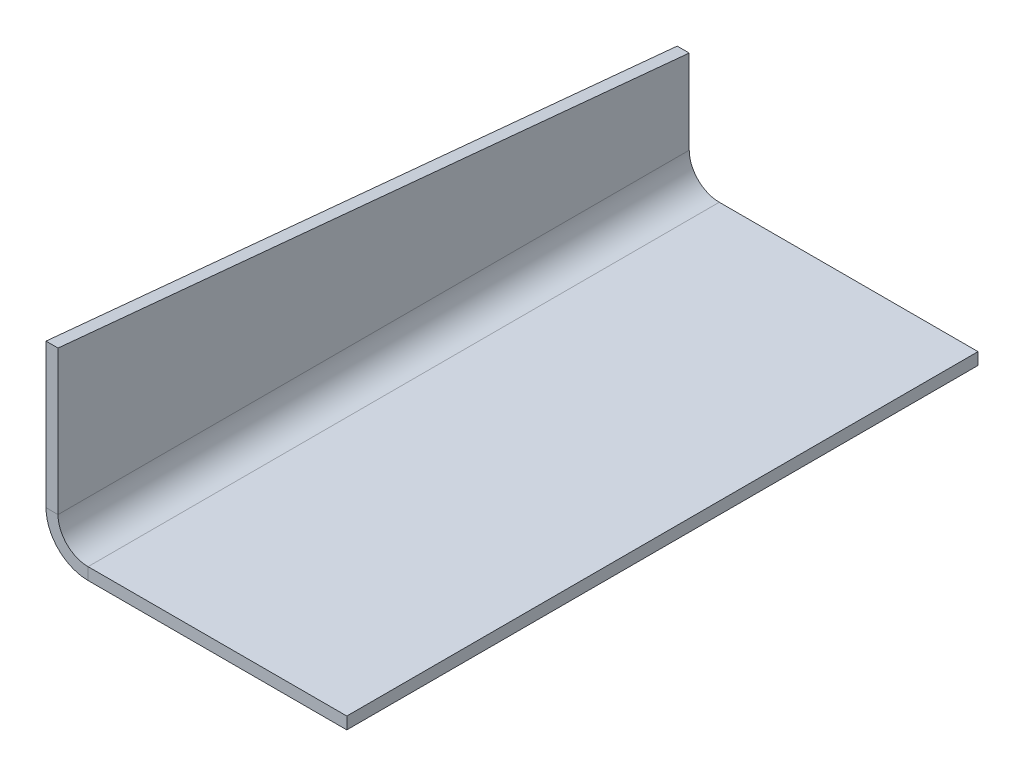
ISO-10303-21;
HEADER;
FILE_DESCRIPTION(('STEP AP214'),'2;1');
FILE_NAME('part.step','',(''),(''),'','','');
FILE_SCHEMA(('AUTOMOTIVE_DESIGN { 1 0 10303 214 1 1 1 1 }'));
ENDSEC;
DATA;
#1=APPLICATION_CONTEXT('core data for automotive mechanical design processes');
#2=APPLICATION_PROTOCOL_DEFINITION('international standard','automotive_design',2000,#1);
#3=PRODUCT_CONTEXT('',#1,'mechanical');
#4=PRODUCT('Part','Part','',(#3));
#5=PRODUCT_RELATED_PRODUCT_CATEGORY('part','',(#4));
#6=PRODUCT_DEFINITION_FORMATION('','',#4);
#7=PRODUCT_DEFINITION_CONTEXT('part definition',#1,'design');
#8=PRODUCT_DEFINITION('design','',#6,#7);
#9=PRODUCT_DEFINITION_SHAPE('','',#8);
#10=(LENGTH_UNIT() NAMED_UNIT(*) SI_UNIT(.MILLI.,.METRE.));
#11=(NAMED_UNIT(*) PLANE_ANGLE_UNIT() SI_UNIT($,.RADIAN.));
#12=(NAMED_UNIT(*) SI_UNIT($,.STERADIAN.) SOLID_ANGLE_UNIT());
#13=UNCERTAINTY_MEASURE_WITH_UNIT(LENGTH_MEASURE(1.E-05),#10,'distance_accuracy_value','');
#14=(GEOMETRIC_REPRESENTATION_CONTEXT(3) GLOBAL_UNCERTAINTY_ASSIGNED_CONTEXT((#13)) GLOBAL_UNIT_ASSIGNED_CONTEXT((#10,
#11,#12)) REPRESENTATION_CONTEXT('',''));
#15=CARTESIAN_POINT('',(0.,0.,0.));
#16=DIRECTION('',(0.,0.,1.));
#17=DIRECTION('',(1.,0.,0.));
#18=AXIS2_PLACEMENT_3D('',#15,#16,#17);
#19=CARTESIAN_POINT('',(330.750713813699,57.9885896402802,210.));
#20=DIRECTION('',(0.,0.995495472593952,-0.0948090926279955));
#21=DIRECTION('',(0.,0.0948090926279955,0.995495472593952));
#22=AXIS2_PLACEMENT_3D('',#19,#20,#21);
#23=PLANE('',#22);
#24=CARTESIAN_POINT('',(-100.075955442805,57.9885896373081,210.000000000283));
#25=CARTESIAN_POINT('',(-100.075955442805,57.155256303982,201.250000000238));
#26=CARTESIAN_POINT('',(-100.075955442805,56.3219229706471,192.500000000194));
#27=CARTESIAN_POINT('',(-100.075955442805,54.6552563039773,175.000000000195));
#28=CARTESIAN_POINT('',(-100.075955442805,53.8219229706424,166.250000000239));
#29=CARTESIAN_POINT('',(-100.075955442805,52.1552563039737,148.750000000327));
#30=CARTESIAN_POINT('',(-100.075955442805,51.3219229706399,140.000000000371));
#31=CARTESIAN_POINT('',(-100.075955442805,49.6552563039722,122.500000000415));
#32=CARTESIAN_POINT('',(-100.075955442805,48.8219229706383,113.750000000416));
#33=CARTESIAN_POINT('',(-100.075955442805,47.1552563039737,96.2500000003713));
#34=CARTESIAN_POINT('',(-100.075955442805,46.3219229706431,87.500000000327));
#35=CARTESIAN_POINT('',(-100.075955442805,44.6552563039773,70.0000000002828));
#36=CARTESIAN_POINT('',(-100.075955442805,43.8219229706421,61.250000000283));
#37=CARTESIAN_POINT('',(-100.075955442805,42.155256303974,43.7500000002831));
#38=CARTESIAN_POINT('',(-100.075955442805,41.3219229706411,35.0000000002831));
#39=CARTESIAN_POINT('',(-100.075955442805,39.6552563039751,17.500000000283));
#40=CARTESIAN_POINT('',(-100.075955442805,38.8219229706421,8.75000000028298));
#41=CARTESIAN_POINT('',(-100.075955442805,37.9885896373081,2.83061998593547E-10));
#42=B_SPLINE_CURVE_WITH_KNOTS('',3,(#24,#25,#26,#27,#28,#29,#30,#31,#32,#33,#34,#35,#36,#37,#38,
#39,#40,#41),.UNSPECIFIED.,.F.,.F.,(4,2,2,2,2,2,2,2,4),(0.,26.3687788872928,52.7375577743225,
79.1063366613521,105.475115548513,131.843894435806,158.212673322967,184.581452210129,
210.95023109729),.UNSPECIFIED.);
#43=CARTESIAN_POINT('',(-100.075955442805,57.9885896402802,210.));
#44=VERTEX_POINT('',#43);
#45=CARTESIAN_POINT('',(-100.075955442805,37.9885896402802,0.));
#46=VERTEX_POINT('',#45);
#47=EDGE_CURVE('E133',#44,#46,#42,.T.);
#48=ORIENTED_EDGE('',*,*,#47,.F.);
#49=DIRECTION('',(-1.,0.,0.));
#50=VECTOR('',#49,1.);
#51=CARTESIAN_POINT('',(330.750713813699,57.9885896402802,210.));
#52=LINE('',#51,#50);
#53=CARTESIAN_POINT('',(-96.0759554428049,57.9885896402802,210.));
#54=VERTEX_POINT('',#53);
#55=EDGE_CURVE('E184',#54,#44,#52,.T.);
#56=ORIENTED_EDGE('',*,*,#55,.F.);
#57=DIRECTION('',(0.,-0.0948090926279955,-0.995495472593952));
#58=VECTOR('',#57,1.);
#59=CARTESIAN_POINT('',(-96.0759554428049,57.9885896402802,210.));
#60=LINE('',#59,#58);
#61=CARTESIAN_POINT('',(-96.0759554428049,37.9885896402802,0.));
#62=VERTEX_POINT('',#61);
#63=EDGE_CURVE('E143',#54,#62,#60,.T.);
#64=ORIENTED_EDGE('',*,*,#63,.T.);
#65=DIRECTION('',(-1.,0.,0.));
#66=VECTOR('',#65,1.);
#67=CARTESIAN_POINT('',(330.750713813699,37.9885896402802,0.));
#68=LINE('',#67,#66);
#69=EDGE_CURVE('E126',#62,#46,#68,.T.);
#70=ORIENTED_EDGE('',*,*,#69,.T.);
#71=EDGE_LOOP('',(#48,#56,#64,#70));
#72=FACE_BOUND('',#71,.T.);
#73=ADVANCED_FACE('F37',(#72),#23,.T.);
#74=CARTESIAN_POINT('',(330.750713813699,10.0000000000001,0.));
#75=DIRECTION('',(0.,0.,1.));
#76=DIRECTION('',(-1.,0.,0.));
#77=AXIS2_PLACEMENT_3D('',#74,#75,#76);
#78=PLANE('',#77);
#79=DIRECTION('',(-1.,0.,0.));
#80=VECTOR('',#79,1.);
#81=CARTESIAN_POINT('',(330.750713813699,9.99999999999999,0.));
#82=LINE('',#81,#80);
#83=CARTESIAN_POINT('',(-96.0759554428049,9.99999999999999,0.));
#84=VERTEX_POINT('',#83);
#85=CARTESIAN_POINT('',(-100.075955442805,10.,0.));
#86=VERTEX_POINT('',#85);
#87=EDGE_CURVE('E117',#84,#86,#82,.T.);
#88=ORIENTED_EDGE('',*,*,#87,.T.);
#89=DIRECTION('',(0.,1.,0.));
#90=VECTOR('',#89,1.);
#91=CARTESIAN_POINT('',(-100.075955442805,0.,0.));
#92=LINE('',#91,#90);
#93=EDGE_CURVE('E120',#86,#46,#92,.T.);
#94=ORIENTED_EDGE('',*,*,#93,.T.);
#95=ORIENTED_EDGE('',*,*,#69,.F.);
#96=DIRECTION('',(0.,1.,0.));
#97=VECTOR('',#96,1.);
#98=CARTESIAN_POINT('',(-96.0759554428049,10.0000000000001,0.));
#99=LINE('',#98,#97);
#100=EDGE_CURVE('E11',#84,#62,#99,.T.);
#101=ORIENTED_EDGE('',*,*,#100,.F.);
#102=EDGE_LOOP('',(#88,#94,#95,#101));
#103=FACE_BOUND('',#102,.T.);
#104=ADVANCED_FACE('F119',(#103),#78,.F.);
#105=CARTESIAN_POINT('',(-100.075955442805,0.,0.));
#106=DIRECTION('',(1.,0.,0.));
#107=DIRECTION('',(0.,0.,-1.));
#108=AXIS2_PLACEMENT_3D('',#105,#106,#107);
#109=PLANE('',#108);
#110=ORIENTED_EDGE('',*,*,#47,.T.);
#111=ORIENTED_EDGE('',*,*,#93,.F.);
#112=DIRECTION('',(0.,0.,-1.));
#113=VECTOR('',#112,1.);
#114=CARTESIAN_POINT('',(-100.075955442805,10.,210.));
#115=LINE('',#114,#113);
#116=CARTESIAN_POINT('',(-100.075955442805,9.99999999999999,210.));
#117=VERTEX_POINT('',#116);
#118=EDGE_CURVE('E131',#117,#86,#115,.T.);
#119=ORIENTED_EDGE('',*,*,#118,.F.);
#120=DIRECTION('',(0.,1.,0.));
#121=VECTOR('',#120,1.);
#122=CARTESIAN_POINT('',(-100.075955442805,0.,210.));
#123=LINE('',#122,#121);
#124=EDGE_CURVE('E189',#117,#44,#123,.T.);
#125=ORIENTED_EDGE('',*,*,#124,.T.);
#126=EDGE_LOOP('',(#110,#111,#119,#125));
#127=FACE_BOUND('',#126,.T.);
#128=ADVANCED_FACE('F130',(#127),#109,.F.);
#129=CARTESIAN_POINT('',(330.750713813699,10.0000000000001,210.));
#130=DIRECTION('',(0.,0.,1.));
#131=DIRECTION('',(-1.,0.,0.));
#132=AXIS2_PLACEMENT_3D('',#129,#130,#131);
#133=PLANE('',#132);
#134=ORIENTED_EDGE('',*,*,#124,.F.);
#135=DIRECTION('',(-1.,0.,0.));
#136=VECTOR('',#135,1.);
#137=CARTESIAN_POINT('',(330.750713813699,9.99999999999999,210.));
#138=LINE('',#137,#136);
#139=CARTESIAN_POINT('',(-96.0759554428049,9.99999999999999,210.));
#140=VERTEX_POINT('',#139);
#141=EDGE_CURVE('E43',#140,#117,#138,.T.);
#142=ORIENTED_EDGE('',*,*,#141,.F.);
#143=DIRECTION('',(0.,1.,0.));
#144=VECTOR('',#143,1.);
#145=CARTESIAN_POINT('',(-96.0759554428049,10.0000000000001,210.));
#146=LINE('',#145,#144);
#147=EDGE_CURVE('E58',#140,#54,#146,.T.);
#148=ORIENTED_EDGE('',*,*,#147,.T.);
#149=ORIENTED_EDGE('',*,*,#55,.T.);
#150=EDGE_LOOP('',(#134,#142,#148,#149));
#151=FACE_BOUND('',#150,.T.);
#152=ADVANCED_FACE('F210',(#151),#133,.T.);
#153=CARTESIAN_POINT('',(-96.0759554428049,0.,0.));
#154=DIRECTION('',(1.,0.,0.));
#155=DIRECTION('',(0.,0.,-1.));
#156=AXIS2_PLACEMENT_3D('',#153,#154,#155);
#157=PLANE('',#156);
#158=ORIENTED_EDGE('',*,*,#63,.F.);
#159=ORIENTED_EDGE('',*,*,#147,.F.);
#160=DIRECTION('',(0.,0.,-1.));
#161=VECTOR('',#160,1.);
#162=CARTESIAN_POINT('',(-96.0759554428049,9.99999999999999,210.));
#163=LINE('',#162,#161);
#164=EDGE_CURVE('E49',#140,#84,#163,.T.);
#165=ORIENTED_EDGE('',*,*,#164,.T.);
#166=ORIENTED_EDGE('',*,*,#100,.T.);
#167=EDGE_LOOP('',(#158,#159,#165,#166));
#168=FACE_BOUND('',#167,.T.);
#169=ADVANCED_FACE('F206',(#168),#157,.T.);
#170=CARTESIAN_POINT('',(0.,-4.,0.));
#171=DIRECTION('',(0.,1.,0.));
#172=DIRECTION('',(0.,0.,1.));
#173=AXIS2_PLACEMENT_3D('',#170,#171,#172);
#174=PLANE('',#173);
#175=DIRECTION('',(0.,0.,1.));
#176=VECTOR('',#175,1.);
#177=CARTESIAN_POINT('',(-86.0759554428049,-4.,0.));
#178=LINE('',#177,#176);
#179=CARTESIAN_POINT('',(-86.0759554428049,-4.,210.));
#180=VERTEX_POINT('',#179);
#181=CARTESIAN_POINT('',(-86.0759554428049,-4.,0.));
#182=VERTEX_POINT('',#181);
#183=EDGE_CURVE('E150',#180,#182,#178,.F.);
#184=ORIENTED_EDGE('',*,*,#183,.T.);
#185=DIRECTION('',(1.,0.,0.));
#186=VECTOR('',#185,1.);
#187=CARTESIAN_POINT('',(0.,-4.,0.));
#188=LINE('',#187,#186);
#189=CARTESIAN_POINT('',(0.,-4.,0.));
#190=VERTEX_POINT('',#189);
#191=EDGE_CURVE('E159',#190,#182,#188,.F.);
#192=ORIENTED_EDGE('',*,*,#191,.F.);
#193=DIRECTION('',(0.,0.,1.));
#194=VECTOR('',#193,1.);
#195=CARTESIAN_POINT('',(0.,-4.,0.));
#196=LINE('',#195,#194);
#197=CARTESIAN_POINT('',(0.,-4.,210.));
#198=VERTEX_POINT('',#197);
#199=EDGE_CURVE('E161',#198,#190,#196,.F.);
#200=ORIENTED_EDGE('',*,*,#199,.F.);
#201=DIRECTION('',(1.,0.,0.));
#202=VECTOR('',#201,1.);
#203=CARTESIAN_POINT('',(0.,-4.,210.));
#204=LINE('',#203,#202);
#205=EDGE_CURVE('E164',#198,#180,#204,.F.);
#206=ORIENTED_EDGE('',*,*,#205,.T.);
#207=EDGE_LOOP('',(#184,#192,#200,#206));
#208=FACE_BOUND('',#207,.T.);
#209=ADVANCED_FACE('F209',(#208),#174,.F.);
#210=CARTESIAN_POINT('',(0.,449.912194616499,210.));
#211=DIRECTION('',(0.,0.,1.));
#212=DIRECTION('',(1.,0.,0.));
#213=AXIS2_PLACEMENT_3D('',#210,#211,#212);
#214=PLANE('',#213);
#215=ORIENTED_EDGE('',*,*,#205,.F.);
#216=DIRECTION('',(0.,-1.,0.));
#217=VECTOR('',#216,1.);
#218=CARTESIAN_POINT('',(0.,449.912194616499,210.));
#219=LINE('',#218,#217);
#220=CARTESIAN_POINT('',(0.,1.11022302462516E-13,210.));
#221=VERTEX_POINT('',#220);
#222=EDGE_CURVE('E177',#221,#198,#219,.T.);
#223=ORIENTED_EDGE('',*,*,#222,.F.);
#224=DIRECTION('',(-1.,0.,0.));
#225=VECTOR('',#224,1.);
#226=CARTESIAN_POINT('',(0.,0.,210.));
#227=LINE('',#226,#225);
#228=CARTESIAN_POINT('',(-86.0759554428049,1.11022302462516E-13,210.));
#229=VERTEX_POINT('',#228);
#230=EDGE_CURVE('E87',#221,#229,#227,.T.);
#231=ORIENTED_EDGE('',*,*,#230,.T.);
#232=DIRECTION('',(0.,-1.,0.));
#233=VECTOR('',#232,1.);
#234=CARTESIAN_POINT('',(-86.0759554428049,449.912194616499,210.));
#235=LINE('',#234,#233);
#236=EDGE_CURVE('E179',#229,#180,#235,.T.);
#237=ORIENTED_EDGE('',*,*,#236,.T.);
#238=EDGE_LOOP('',(#215,#223,#231,#237));
#239=FACE_BOUND('',#238,.T.);
#240=ADVANCED_FACE('F221',(#239),#214,.T.);
#241=CARTESIAN_POINT('',(0.,449.912194616499,210.));
#242=DIRECTION('',(-1.,0.,0.));
#243=DIRECTION('',(0.,0.,1.));
#244=AXIS2_PLACEMENT_3D('',#241,#242,#243);
#245=PLANE('',#244);
#246=ORIENTED_EDGE('',*,*,#222,.T.);
#247=ORIENTED_EDGE('',*,*,#199,.T.);
#248=DIRECTION('',(0.,-1.,0.));
#249=VECTOR('',#248,1.);
#250=CARTESIAN_POINT('',(0.,449.912194616499,0.));
#251=LINE('',#250,#249);
#252=CARTESIAN_POINT('',(0.,1.11022302462516E-13,0.));
#253=VERTEX_POINT('',#252);
#254=EDGE_CURVE('E174',#253,#190,#251,.T.);
#255=ORIENTED_EDGE('',*,*,#254,.F.);
#256=DIRECTION('',(0.,0.,-1.));
#257=VECTOR('',#256,1.);
#258=CARTESIAN_POINT('',(0.,0.,210.));
#259=LINE('',#258,#257);
#260=EDGE_CURVE('E95',#221,#253,#259,.T.);
#261=ORIENTED_EDGE('',*,*,#260,.F.);
#262=EDGE_LOOP('',(#246,#247,#255,#261));
#263=FACE_BOUND('',#262,.T.);
#264=ADVANCED_FACE('F224',(#263),#245,.F.);
#265=CARTESIAN_POINT('',(0.,449.912194616499,0.));
#266=DIRECTION('',(0.,0.,1.));
#267=DIRECTION('',(1.,0.,0.));
#268=AXIS2_PLACEMENT_3D('',#265,#266,#267);
#269=PLANE('',#268);
#270=ORIENTED_EDGE('',*,*,#254,.T.);
#271=ORIENTED_EDGE('',*,*,#191,.T.);
#272=DIRECTION('',(0.,-1.,0.));
#273=VECTOR('',#272,1.);
#274=CARTESIAN_POINT('',(-86.0759554428049,449.912194616499,0.));
#275=LINE('',#274,#273);
#276=CARTESIAN_POINT('',(-86.0759554428049,0.,0.));
#277=VERTEX_POINT('',#276);
#278=EDGE_CURVE('E147',#277,#182,#275,.T.);
#279=ORIENTED_EDGE('',*,*,#278,.F.);
#280=DIRECTION('',(-1.,0.,0.));
#281=VECTOR('',#280,1.);
#282=CARTESIAN_POINT('',(0.,0.,0.));
#283=LINE('',#282,#281);
#284=EDGE_CURVE('E171',#253,#277,#283,.T.);
#285=ORIENTED_EDGE('',*,*,#284,.F.);
#286=EDGE_LOOP('',(#270,#271,#279,#285));
#287=FACE_BOUND('',#286,.T.);
#288=ADVANCED_FACE('F227',(#287),#269,.F.);
#289=CARTESIAN_POINT('',(0.,0.,0.));
#290=DIRECTION('',(0.,1.,0.));
#291=DIRECTION('',(0.,0.,1.));
#292=AXIS2_PLACEMENT_3D('',#289,#290,#291);
#293=PLANE('',#292);
#294=DIRECTION('',(0.,0.,-1.));
#295=VECTOR('',#294,1.);
#296=CARTESIAN_POINT('',(-86.0759554428049,0.,210.));
#297=LINE('',#296,#295);
#298=EDGE_CURVE('E166',#229,#277,#297,.T.);
#299=ORIENTED_EDGE('',*,*,#298,.F.);
#300=ORIENTED_EDGE('',*,*,#230,.F.);
#301=ORIENTED_EDGE('',*,*,#260,.T.);
#302=ORIENTED_EDGE('',*,*,#284,.T.);
#303=EDGE_LOOP('',(#299,#300,#301,#302));
#304=FACE_BOUND('',#303,.T.);
#305=ADVANCED_FACE('F230',(#304),#293,.T.);
#306=CARTESIAN_POINT('',(-86.0759554428049,10.,0.));
#307=DIRECTION('',(0.,0.,-1.));
#308=DIRECTION('',(-1.,0.,0.));
#309=AXIS2_PLACEMENT_3D('',#306,#307,#308);
#310=PLANE('',#309);
#311=ORIENTED_EDGE('',*,*,#87,.F.);
#312=CARTESIAN_POINT('',(-86.0759554428049,10.,0.));
#313=DIRECTION('',(0.,0.,1.));
#314=DIRECTION('',(1.,0.,0.));
#315=AXIS2_PLACEMENT_3D('',#312,#313,#314);
#316=CIRCLE('',#315,9.99999999999999);
#317=EDGE_CURVE('E153',#84,#277,#316,.T.);
#318=ORIENTED_EDGE('',*,*,#317,.T.);
#319=ORIENTED_EDGE('',*,*,#278,.T.);
#320=CARTESIAN_POINT('',(-86.0759554428049,10.,0.));
#321=DIRECTION('',(0.,0.,1.));
#322=DIRECTION('',(1.,0.,0.));
#323=AXIS2_PLACEMENT_3D('',#320,#321,#322);
#324=CIRCLE('',#323,14.);
#325=EDGE_CURVE('E140',#86,#182,#324,.T.);
#326=ORIENTED_EDGE('',*,*,#325,.F.);
#327=EDGE_LOOP('',(#311,#318,#319,#326));
#328=FACE_BOUND('',#327,.T.);
#329=ADVANCED_FACE('F145',(#328),#310,.T.);
#330=CARTESIAN_POINT('',(-86.0759554428049,10.,210.));
#331=DIRECTION('',(0.,0.,1.));
#332=DIRECTION('',(1.,0.,0.));
#333=AXIS2_PLACEMENT_3D('',#330,#331,#332);
#334=PLANE('',#333);
#335=CARTESIAN_POINT('',(-86.0759554428049,10.,210.));
#336=DIRECTION('',(0.,0.,1.));
#337=DIRECTION('',(1.,0.,0.));
#338=AXIS2_PLACEMENT_3D('',#335,#336,#337);
#339=CIRCLE('',#338,9.99999999999999);
#340=EDGE_CURVE('E148',#229,#140,#339,.F.);
#341=ORIENTED_EDGE('',*,*,#340,.T.);
#342=ORIENTED_EDGE('',*,*,#141,.T.);
#343=CARTESIAN_POINT('',(-86.0759554428049,10.,210.));
#344=DIRECTION('',(0.,0.,1.));
#345=DIRECTION('',(1.,0.,0.));
#346=AXIS2_PLACEMENT_3D('',#343,#344,#345);
#347=CIRCLE('',#346,14.);
#348=EDGE_CURVE('E142',#180,#117,#347,.F.);
#349=ORIENTED_EDGE('',*,*,#348,.F.);
#350=ORIENTED_EDGE('',*,*,#236,.F.);
#351=EDGE_LOOP('',(#341,#342,#349,#350));
#352=FACE_BOUND('',#351,.T.);
#353=ADVANCED_FACE('F238',(#352),#334,.T.);
#354=CARTESIAN_POINT('',(-86.0759554428049,10.,-259.827578440556));
#355=DIRECTION('',(0.,0.,1.));
#356=DIRECTION('',(1.,0.,0.));
#357=AXIS2_PLACEMENT_3D('',#354,#355,#356);
#358=CYLINDRICAL_SURFACE('',#357,14.);
#359=ORIENTED_EDGE('',*,*,#183,.F.);
#360=ORIENTED_EDGE('',*,*,#348,.T.);
#361=ORIENTED_EDGE('',*,*,#118,.T.);
#362=ORIENTED_EDGE('',*,*,#325,.T.);
#363=EDGE_LOOP('',(#359,#360,#361,#362));
#364=FACE_BOUND('',#363,.T.);
#365=ADVANCED_FACE('F139',(#364),#358,.T.);
#366=CARTESIAN_POINT('',(-86.0759554428049,10.,-259.827578440556));
#367=DIRECTION('',(0.,0.,1.));
#368=DIRECTION('',(1.,0.,0.));
#369=AXIS2_PLACEMENT_3D('',#366,#367,#368);
#370=CYLINDRICAL_SURFACE('',#369,9.99999999999999);
#371=ORIENTED_EDGE('',*,*,#298,.T.);
#372=ORIENTED_EDGE('',*,*,#317,.F.);
#373=ORIENTED_EDGE('',*,*,#164,.F.);
#374=ORIENTED_EDGE('',*,*,#340,.F.);
#375=EDGE_LOOP('',(#371,#372,#373,#374));
#376=FACE_BOUND('',#375,.T.);
#377=ADVANCED_FACE('F244',(#376),#370,.F.);
#378=CLOSED_SHELL('',(#73,#104,#128,#152,#169,#209,#240,#264,#288,#305,#329,#353,#365,#377));
#379=MANIFOLD_SOLID_BREP('B2',#378);
#380=ADVANCED_BREP_SHAPE_REPRESENTATION('',(#18,#379),#14);
#381=SHAPE_DEFINITION_REPRESENTATION(#9,#380);
ENDSEC;
END-ISO-10303-21;
